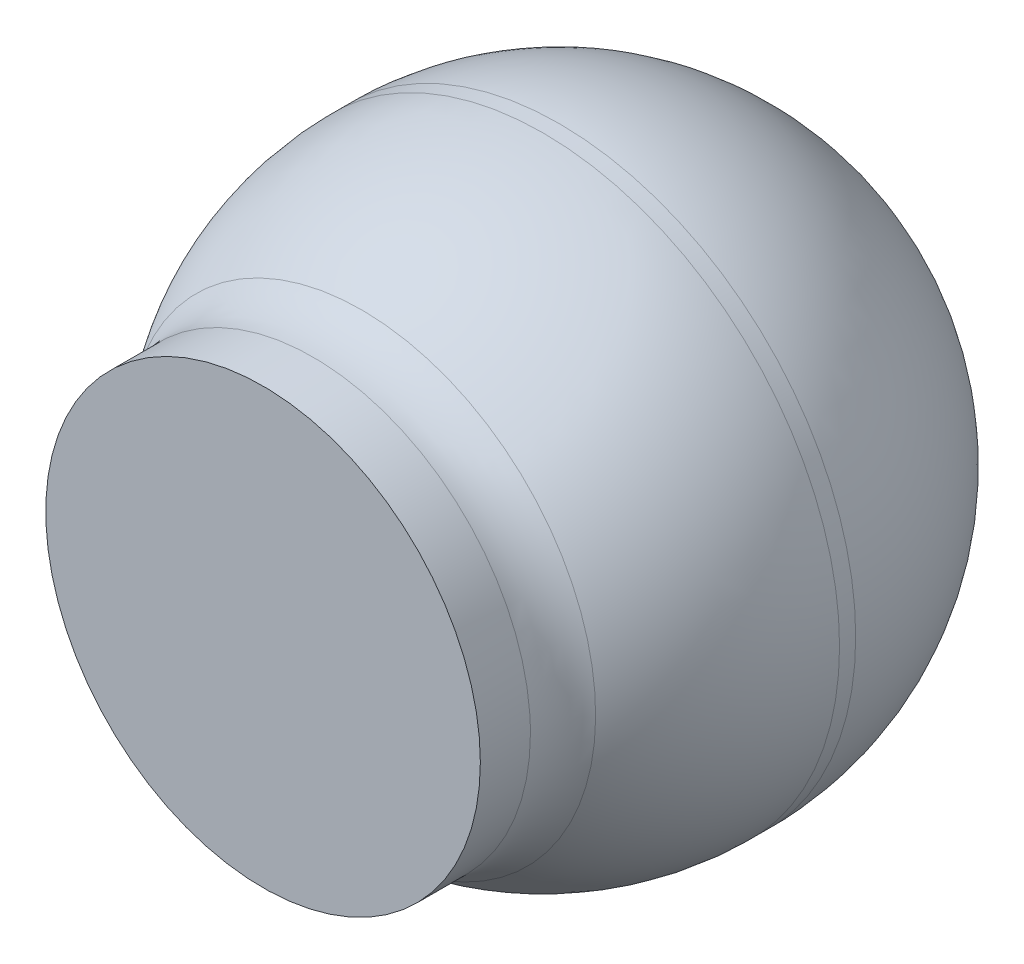
ISO-10303-21;
HEADER;
FILE_DESCRIPTION(('STEP AP214'),'2;1');
FILE_NAME('part.step','',(''),(''),'','','');
FILE_SCHEMA(('AUTOMOTIVE_DESIGN { 1 0 10303 214 1 1 1 1 }'));
ENDSEC;
DATA;
#1=APPLICATION_CONTEXT('core data for automotive mechanical design processes');
#2=APPLICATION_PROTOCOL_DEFINITION('international standard','automotive_design',2000,#1);
#3=PRODUCT_CONTEXT('',#1,'mechanical');
#4=PRODUCT('Part','Part','',(#3));
#5=PRODUCT_RELATED_PRODUCT_CATEGORY('part','',(#4));
#6=PRODUCT_DEFINITION_FORMATION('','',#4);
#7=PRODUCT_DEFINITION_CONTEXT('part definition',#1,'design');
#8=PRODUCT_DEFINITION('design','',#6,#7);
#9=PRODUCT_DEFINITION_SHAPE('','',#8);
#10=(LENGTH_UNIT() NAMED_UNIT(*) SI_UNIT(.MILLI.,.METRE.));
#11=(NAMED_UNIT(*) PLANE_ANGLE_UNIT() SI_UNIT($,.RADIAN.));
#12=(NAMED_UNIT(*) SI_UNIT($,.STERADIAN.) SOLID_ANGLE_UNIT());
#13=UNCERTAINTY_MEASURE_WITH_UNIT(LENGTH_MEASURE(1.E-05),#10,'distance_accuracy_value','');
#14=(GEOMETRIC_REPRESENTATION_CONTEXT(3) GLOBAL_UNCERTAINTY_ASSIGNED_CONTEXT((#13)) GLOBAL_UNIT_ASSIGNED_CONTEXT((#10,
#11,#12)) REPRESENTATION_CONTEXT('',''));
#15=CARTESIAN_POINT('',(0.,0.,0.));
#16=DIRECTION('',(0.,0.,1.));
#17=DIRECTION('',(1.,0.,0.));
#18=AXIS2_PLACEMENT_3D('',#15,#16,#17);
#19=CARTESIAN_POINT('',(-5.642919922269,-1.511349291452,10.006534503384));
#20=DIRECTION('',(0.,0.,-1.));
#21=DIRECTION('',(-1.,0.,0.));
#22=AXIS2_PLACEMENT_3D('',#19,#20,#21);
#23=PLANE('',#22);
#24=CARTESIAN_POINT('',(-5.642919922269,-1.511349291452,10.006534503384));
#25=DIRECTION('',(0.,0.,1.));
#26=DIRECTION('',(1.,0.,0.));
#27=AXIS2_PLACEMENT_3D('',#24,#25,#26);
#28=CIRCLE('',#27,0.275);
#29=CARTESIAN_POINT('',(-5.367919922269,-1.511349291452,10.006534503384));
#30=VERTEX_POINT('',#29);
#31=EDGE_CURVE('E20',#30,#30,#28,.F.);
#32=ORIENTED_EDGE('',*,*,#31,.F.);
#33=EDGE_LOOP('',(#32));
#34=FACE_BOUND('',#33,.T.);
#35=ADVANCED_FACE('F17',(#34),#23,.F.);
#36=CARTESIAN_POINT('',(-5.642919922269,-1.511349291452,9.906534503384));
#37=DIRECTION('',(0.,0.,1.));
#38=DIRECTION('',(1.,0.,0.));
#39=AXIS2_PLACEMENT_3D('',#36,#37,#38);
#40=CYLINDRICAL_SURFACE('',#39,0.275);
#41=CARTESIAN_POINT('',(-5.642919922269,-1.511349291452,9.943180457728));
#42=DIRECTION('',(0.,0.,-1.));
#43=DIRECTION('',(0.996700902337582,0.0811622527992462,0.));
#44=AXIS2_PLACEMENT_3D('',#41,#42,#43);
#45=CIRCLE('',#44,0.275);
#46=CARTESIAN_POINT('',(-5.36882717412616,-1.48902967193221,9.943180457728));
#47=VERTEX_POINT('',#46);
#48=EDGE_CURVE('E65',#47,#47,#45,.F.);
#49=ORIENTED_EDGE('',*,*,#48,.T.);
#50=EDGE_LOOP('',(#49));
#51=FACE_BOUND('',#50,.T.);
#52=ORIENTED_EDGE('',*,*,#31,.T.);
#53=EDGE_LOOP('',(#52));
#54=FACE_BOUND('',#53,.T.);
#55=ADVANCED_FACE('F62',(#51,#54),#40,.T.);
#56=CARTESIAN_POINT('',(-5.642919922269,-1.511349291452,9.943180457728));
#57=DIRECTION('',(0.,0.,-1.));
#58=DIRECTION('',(0.996700902337583,0.081162252799246,0.));
#59=AXIS2_PLACEMENT_3D('',#56,#57,#58);
#60=TOROIDAL_SURFACE('',#59,0.375,0.1);
#61=ORIENTED_EDGE('',*,*,#48,.F.);
#62=EDGE_LOOP('',(#61));
#63=FACE_BOUND('',#62,.T.);
#64=CARTESIAN_POINT('',(-5.642919922269,-1.511349291452,9.881744931236));
#65=DIRECTION('',(0.,0.,-1.));
#66=DIRECTION('',(-0.996700902337598,-0.0811622527990613,0.));
#67=AXIS2_PLACEMENT_3D('',#64,#65,#66);
#68=CIRCLE('',#67,0.296097046412666);
#69=CARTESIAN_POINT('',(-5.938040115608,-1.535381194786,9.881744931236));
#70=VERTEX_POINT('',#69);
#71=EDGE_CURVE('E39',#70,#70,#68,.T.);
#72=ORIENTED_EDGE('',*,*,#71,.F.);
#73=EDGE_LOOP('',(#72));
#74=FACE_BOUND('',#73,.T.);
#75=ADVANCED_FACE('F57',(#63,#74),#60,.F.);
#76=CARTESIAN_POINT('',(-6.016682760645,-1.541785136252,9.651976062157));
#77=CARTESIAN_POINT('',(-6.016682760645,-1.541785136252,9.701461392103));
#78=CARTESIAN_POINT('',(-6.008526217348,-1.541120941579,9.750947004335));
#79=CARTESIAN_POINT('',(-5.992207085349,-1.539792059952,9.798626332798));
#80=CARTESIAN_POINT('',(-5.968341390838,-1.537848654938,9.842699544317));
#81=CARTESIAN_POINT('',(-5.938040115608,-1.535381194786,9.881744931236));
#82=(BOUNDED_CURVE() B_SPLINE_CURVE(5,(#76,#77,#78,#79,#80,#81),.UNSPECIFIED.,.F.,
.F.) B_SPLINE_CURVE_WITH_KNOTS((6,6),(0.,0.661568582165),
.UNSPECIFIED.) CURVE() GEOMETRIC_REPRESENTATION_ITEM() RATIONAL_B_SPLINE_CURVE((1.,1.,1.,1.,1.,1.)) REPRESENTATION_ITEM(''));
#83=CARTESIAN_POINT('',(-5.642919922269,-1.511349291452,9.651976062157));
#84=DIRECTION('',(0.,0.,-1.));
#85=AXIS1_PLACEMENT('',#83,#84);
#86=SURFACE_OF_REVOLUTION('',#82,#85);
#87=CARTESIAN_POINT('',(-5.642919922269,-1.511349291452,9.651976062157));
#88=DIRECTION('',(0.,0.,1.));
#89=DIRECTION('',(1.,0.,0.));
#90=AXIS2_PLACEMENT_3D('',#87,#88,#89);
#91=CIRCLE('',#90,0.375);
#92=CARTESIAN_POINT('',(-5.267919922269,-1.511349291452,9.651976062157));
#93=VERTEX_POINT('',#92);
#94=EDGE_CURVE('E36',#93,#93,#91,.F.);
#95=ORIENTED_EDGE('',*,*,#94,.F.);
#96=EDGE_LOOP('',(#95));
#97=FACE_BOUND('',#96,.T.);
#98=ORIENTED_EDGE('',*,*,#71,.T.);
#99=EDGE_LOOP('',(#98));
#100=FACE_BOUND('',#99,.T.);
#101=ADVANCED_FACE('F53',(#97,#100),#86,.F.);
#102=CARTESIAN_POINT('',(-5.642919922269,-1.511349291452,9.256534503384));
#103=DIRECTION('',(0.,0.,1.));
#104=DIRECTION('',(1.,0.,0.));
#105=AXIS2_PLACEMENT_3D('',#102,#103,#104);
#106=CYLINDRICAL_SURFACE('',#105,0.375);
#107=CARTESIAN_POINT('',(-5.642919922269,-1.511349291452,9.631534503384));
#108=DIRECTION('',(0.,0.,-1.));
#109=DIRECTION('',(0.0811622527992356,-0.996700902337583,0.));
#110=AXIS2_PLACEMENT_3D('',#107,#108,#109);
#111=CIRCLE('',#110,0.375);
#112=CARTESIAN_POINT('',(-5.61248407746929,-1.88511212982859,9.631534503384));
#113=VERTEX_POINT('',#112);
#114=CARTESIAN_POINT('',(-5.67335576706871,-1.13758645307541,9.631534503384));
#115=VERTEX_POINT('',#114);
#116=EDGE_CURVE('E11',#113,#115,#111,.T.);
#117=ORIENTED_EDGE('',*,*,#116,.F.);
#118=CARTESIAN_POINT('',(-5.642919922269,-1.511349291452,9.631534503384));
#119=DIRECTION('',(0.,0.,1.));
#120=DIRECTION('',(0.0811622527992365,-0.996700902337583,0.));
#121=AXIS2_PLACEMENT_3D('',#118,#119,#120);
#122=CIRCLE('',#121,0.375);
#123=EDGE_CURVE('E25',#115,#113,#122,.F.);
#124=ORIENTED_EDGE('',*,*,#123,.F.);
#125=EDGE_LOOP('',(#117,#124));
#126=FACE_BOUND('',#125,.T.);
#127=ORIENTED_EDGE('',*,*,#94,.T.);
#128=EDGE_LOOP('',(#127));
#129=FACE_BOUND('',#128,.T.);
#130=ADVANCED_FACE('F34',(#126,#129),#106,.T.);
#131=CARTESIAN_POINT('',(-5.642919922269,-1.511349291452,9.631534503384));
#132=DIRECTION('',(0.0811622527992361,-0.996700902337583,0.));
#133=DIRECTION('',(-0.996700902337583,-0.0811622527992361,0.));
#134=AXIS2_PLACEMENT_3D('',#131,#132,#133);
#135=SPHERICAL_SURFACE('',#134,0.375);
#136=ORIENTED_EDGE('',*,*,#123,.T.);
#137=ORIENTED_EDGE('',*,*,#116,.T.);
#138=EDGE_LOOP('',(#136,#137));
#139=FACE_BOUND('',#138,.T.);
#140=ADVANCED_FACE('F32',(#139),#135,.T.);
#141=CLOSED_SHELL('',(#35,#55,#75,#101,#130,#140));
#142=MANIFOLD_SOLID_BREP('B1',#141);
#143=ADVANCED_BREP_SHAPE_REPRESENTATION('',(#18,#142),#14);
#144=SHAPE_DEFINITION_REPRESENTATION(#9,#143);
ENDSEC;
END-ISO-10303-21;
